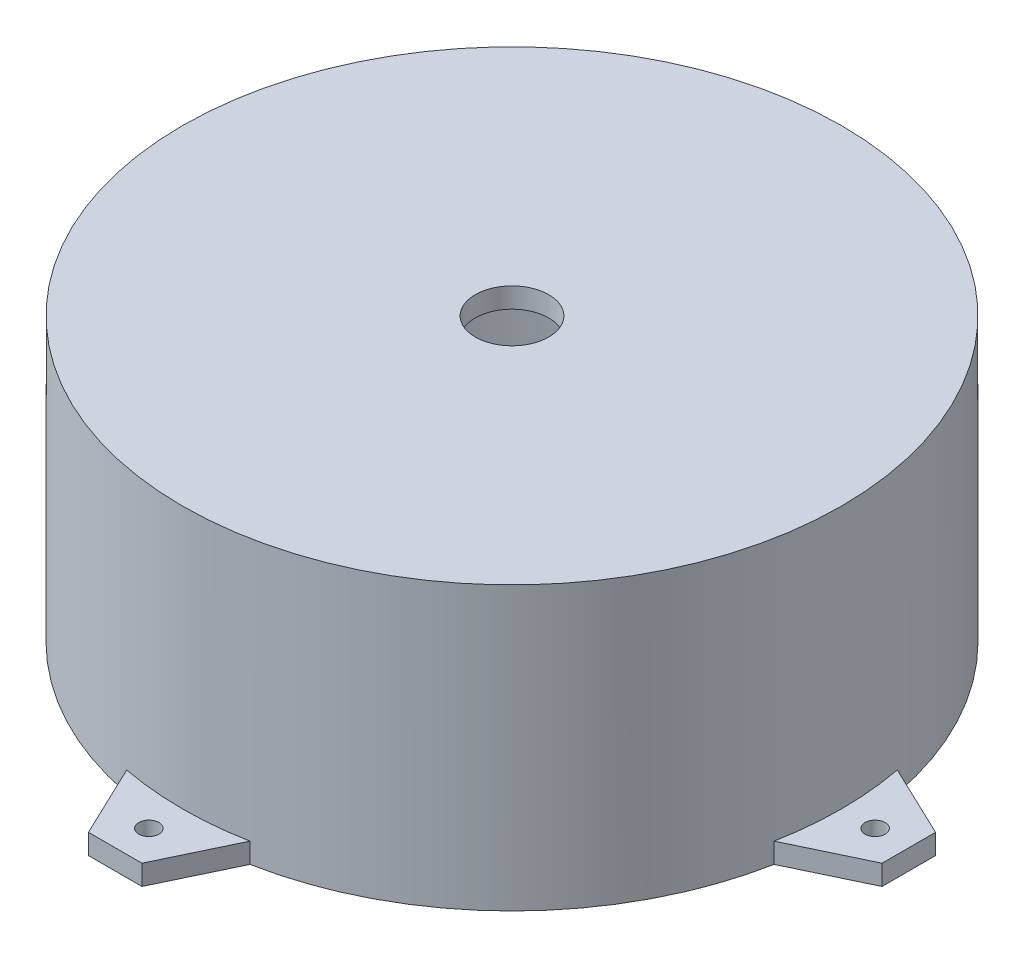
ISO-10303-21;
HEADER;
FILE_DESCRIPTION(('STEP AP214'),'2;1');
FILE_NAME('part.step','',(''),(''),'','','');
FILE_SCHEMA(('AUTOMOTIVE_DESIGN { 1 0 10303 214 1 1 1 1 }'));
ENDSEC;
DATA;
#1=APPLICATION_CONTEXT('core data for automotive mechanical design processes');
#2=APPLICATION_PROTOCOL_DEFINITION('international standard','automotive_design',2000,#1);
#3=PRODUCT_CONTEXT('',#1,'mechanical');
#4=PRODUCT('Part','Part','',(#3));
#5=PRODUCT_RELATED_PRODUCT_CATEGORY('part','',(#4));
#6=PRODUCT_DEFINITION_FORMATION('','',#4);
#7=PRODUCT_DEFINITION_CONTEXT('part definition',#1,'design');
#8=PRODUCT_DEFINITION('design','',#6,#7);
#9=PRODUCT_DEFINITION_SHAPE('','',#8);
#10=(LENGTH_UNIT() NAMED_UNIT(*) SI_UNIT(.MILLI.,.METRE.));
#11=(NAMED_UNIT(*) PLANE_ANGLE_UNIT() SI_UNIT($,.RADIAN.));
#12=(NAMED_UNIT(*) SI_UNIT($,.STERADIAN.) SOLID_ANGLE_UNIT());
#13=UNCERTAINTY_MEASURE_WITH_UNIT(LENGTH_MEASURE(1.E-05),#10,'distance_accuracy_value','');
#14=(GEOMETRIC_REPRESENTATION_CONTEXT(3) GLOBAL_UNCERTAINTY_ASSIGNED_CONTEXT((#13)) GLOBAL_UNIT_ASSIGNED_CONTEXT((#10,
#11,#12)) REPRESENTATION_CONTEXT('',''));
#15=CARTESIAN_POINT('',(0.,0.,0.));
#16=DIRECTION('',(0.,0.,1.));
#17=DIRECTION('',(1.,0.,0.));
#18=AXIS2_PLACEMENT_3D('',#15,#16,#17);
#19=CARTESIAN_POINT('',(-5.78726557773744,31.8512759170654,0.));
#20=DIRECTION('',(0.,-1.,0.));
#21=DIRECTION('',(0.,0.,-1.));
#22=AXIS2_PLACEMENT_3D('',#19,#20,#21);
#23=CYLINDRICAL_SURFACE('',#22,49.);
#24=CARTESIAN_POINT('',(-5.78726557773744,34.8512759170654,0.));
#25=DIRECTION('',(0.,-1.,0.));
#26=DIRECTION('',(0.,0.,-1.));
#27=AXIS2_PLACEMENT_3D('',#24,#25,#26);
#28=CIRCLE('',#27,49.);
#29=CARTESIAN_POINT('',(-5.78726557773744,34.8512759170654,-49.));
#30=VERTEX_POINT('',#29);
#31=EDGE_CURVE('E277',#30,#30,#28,.T.);
#32=ORIENTED_EDGE('',*,*,#31,.T.);
#33=EDGE_LOOP('',(#32));
#34=FACE_BOUND('',#33,.T.);
#35=CARTESIAN_POINT('',(-5.78726557773744,-4.14872408293461,0.));
#36=DIRECTION('',(0.,-1.,0.));
#37=DIRECTION('',(-1.,0.,0.));
#38=AXIS2_PLACEMENT_3D('',#35,#36,#37);
#39=CIRCLE('',#38,49.);
#40=CARTESIAN_POINT('',(3.37210493219753,-4.14872408293461,48.1363265306124));
#41=VERTEX_POINT('',#40);
#42=CARTESIAN_POINT('',(-14.9466360876734,-4.14872408293461,48.1363265306122));
#43=VERTEX_POINT('',#42);
#44=EDGE_CURVE('E168',#41,#43,#39,.T.);
#45=ORIENTED_EDGE('',*,*,#44,.F.);
#46=DIRECTION('',(0.,-1.,0.));
#47=VECTOR('',#46,1.);
#48=CARTESIAN_POINT('',(3.37210493219753,-4.14872408293461,48.1363265306124));
#49=LINE('',#48,#47);
#50=CARTESIAN_POINT('',(3.37210493219753,-7.14872408293461,48.1363265306124));
#51=VERTEX_POINT('',#50);
#52=EDGE_CURVE('E172',#41,#51,#49,.T.);
#53=ORIENTED_EDGE('',*,*,#52,.T.);
#54=CARTESIAN_POINT('',(-5.78726557773744,-7.14872408293461,0.));
#55=DIRECTION('',(0.,-1.,0.));
#56=DIRECTION('',(0.,0.,-1.));
#57=AXIS2_PLACEMENT_3D('',#54,#55,#56);
#58=CIRCLE('',#57,49.);
#59=CARTESIAN_POINT('',(42.3490609528748,-7.14872408293461,9.15937050993548));
#60=VERTEX_POINT('',#59);
#61=EDGE_CURVE('E373',#60,#51,#58,.T.);
#62=ORIENTED_EDGE('',*,*,#61,.F.);
#63=DIRECTION('',(0.,-1.,0.));
#64=VECTOR('',#63,1.);
#65=CARTESIAN_POINT('',(42.3490609528748,-4.14872408293461,9.15937050993547));
#66=LINE('',#65,#64);
#67=CARTESIAN_POINT('',(42.3490609528748,-4.14872408293461,9.15937050993547));
#68=VERTEX_POINT('',#67);
#69=EDGE_CURVE('E209',#68,#60,#66,.T.);
#70=ORIENTED_EDGE('',*,*,#69,.F.);
#71=CARTESIAN_POINT('',(-5.78726557773744,-4.14872408293461,0.));
#72=DIRECTION('',(0.,-1.,0.));
#73=DIRECTION('',(0.,0.,1.));
#74=AXIS2_PLACEMENT_3D('',#71,#72,#73);
#75=CIRCLE('',#74,49.);
#76=CARTESIAN_POINT('',(42.3490609528748,-4.14872408293461,-9.15937050993547));
#77=VERTEX_POINT('',#76);
#78=EDGE_CURVE('E198',#77,#68,#75,.T.);
#79=ORIENTED_EDGE('',*,*,#78,.F.);
#80=DIRECTION('',(0.,-1.,0.));
#81=VECTOR('',#80,1.);
#82=CARTESIAN_POINT('',(42.3490609528748,-4.14872408293461,-9.15937050993547));
#83=LINE('',#82,#81);
#84=CARTESIAN_POINT('',(42.3490609528748,-7.14872408293461,-9.15937050993547));
#85=VERTEX_POINT('',#84);
#86=EDGE_CURVE('E205',#77,#85,#83,.T.);
#87=ORIENTED_EDGE('',*,*,#86,.T.);
#88=CARTESIAN_POINT('',(3.3721049321982,-7.14872408293461,-48.1363265306122));
#89=VERTEX_POINT('',#88);
#90=EDGE_CURVE('E278',#89,#85,#58,.T.);
#91=ORIENTED_EDGE('',*,*,#90,.F.);
#92=DIRECTION('',(0.,-1.,0.));
#93=VECTOR('',#92,1.);
#94=CARTESIAN_POINT('',(3.3721049321982,-4.14872408293461,-48.1363265306122));
#95=LINE('',#94,#93);
#96=CARTESIAN_POINT('',(3.3721049321982,-4.14872408293461,-48.1363265306122));
#97=VERTEX_POINT('',#96);
#98=EDGE_CURVE('E234',#97,#89,#95,.T.);
#99=ORIENTED_EDGE('',*,*,#98,.F.);
#100=CARTESIAN_POINT('',(-5.78726557773744,-4.14872408293461,0.));
#101=DIRECTION('',(0.,-1.,0.));
#102=DIRECTION('',(1.,0.,0.));
#103=AXIS2_PLACEMENT_3D('',#100,#101,#102);
#104=CIRCLE('',#103,49.);
#105=CARTESIAN_POINT('',(-14.9466360876727,-4.14872408293461,-48.1363265306123));
#106=VERTEX_POINT('',#105);
#107=EDGE_CURVE('E223',#106,#97,#104,.T.);
#108=ORIENTED_EDGE('',*,*,#107,.F.);
#109=DIRECTION('',(0.,-1.,0.));
#110=VECTOR('',#109,1.);
#111=CARTESIAN_POINT('',(-14.9466360876727,-4.14872408293461,-48.1363265306123));
#112=LINE('',#111,#110);
#113=CARTESIAN_POINT('',(-14.9466360876727,-7.14872408293461,-48.1363265306123));
#114=VERTEX_POINT('',#113);
#115=EDGE_CURVE('E230',#106,#114,#112,.T.);
#116=ORIENTED_EDGE('',*,*,#115,.T.);
#117=CARTESIAN_POINT('',(-53.9235921083497,-7.14872408293461,-9.15937050993547));
#118=VERTEX_POINT('',#117);
#119=EDGE_CURVE('E274',#118,#114,#58,.T.);
#120=ORIENTED_EDGE('',*,*,#119,.F.);
#121=DIRECTION('',(0.,-1.,0.));
#122=VECTOR('',#121,1.);
#123=CARTESIAN_POINT('',(-53.9235921083497,-4.14872408293461,-9.15937050993547));
#124=LINE('',#123,#122);
#125=CARTESIAN_POINT('',(-53.9235921083497,-4.14872408293461,-9.15937050993547));
#126=VERTEX_POINT('',#125);
#127=EDGE_CURVE('E267',#126,#118,#124,.T.);
#128=ORIENTED_EDGE('',*,*,#127,.F.);
#129=CARTESIAN_POINT('',(-5.78726557773744,-4.14872408293461,0.));
#130=DIRECTION('',(0.,-1.,0.));
#131=DIRECTION('',(0.,0.,-1.));
#132=AXIS2_PLACEMENT_3D('',#129,#130,#131);
#133=CIRCLE('',#132,49.);
#134=CARTESIAN_POINT('',(-53.9235921083497,-4.14872408293461,9.15937050993547));
#135=VERTEX_POINT('',#134);
#136=EDGE_CURVE('E255',#135,#126,#133,.T.);
#137=ORIENTED_EDGE('',*,*,#136,.F.);
#138=DIRECTION('',(0.,-1.,0.));
#139=VECTOR('',#138,1.);
#140=CARTESIAN_POINT('',(-53.9235921083497,-4.14872408293461,9.15937050993547));
#141=LINE('',#140,#139);
#142=CARTESIAN_POINT('',(-53.9235921083497,-7.14872408293461,9.15937050993547));
#143=VERTEX_POINT('',#142);
#144=EDGE_CURVE('E263',#135,#143,#141,.T.);
#145=ORIENTED_EDGE('',*,*,#144,.T.);
#146=CARTESIAN_POINT('',(-14.9466360876734,-7.14872408293461,48.1363265306122));
#147=VERTEX_POINT('',#146);
#148=EDGE_CURVE('E266',#147,#143,#58,.T.);
#149=ORIENTED_EDGE('',*,*,#148,.F.);
#150=DIRECTION('',(0.,-1.,0.));
#151=VECTOR('',#150,1.);
#152=CARTESIAN_POINT('',(-14.9466360876734,-4.14872408293461,48.1363265306122));
#153=LINE('',#152,#151);
#154=EDGE_CURVE('E188',#43,#147,#153,.T.);
#155=ORIENTED_EDGE('',*,*,#154,.F.);
#156=EDGE_LOOP('',(#45,#53,#62,#70,#79,#87,#91,#99,#108,#116,#120,#128,#137,#145,#149,#155));
#157=FACE_BOUND('',#156,.T.);
#158=ADVANCED_FACE('F36',(#34,#157),#23,.T.);
#159=CARTESIAN_POINT('',(40.2127344222626,-7.14872408293461,0.));
#160=DIRECTION('',(0.,-1.,0.));
#161=DIRECTION('',(0.,0.,-1.));
#162=AXIS2_PLACEMENT_3D('',#159,#160,#161);
#163=PLANE('',#162);
#164=CARTESIAN_POINT('',(-5.78726557773801,-7.14872408293461,54.));
#165=DIRECTION('',(0.,-1.,0.));
#166=DIRECTION('',(-1.,0.,0.));
#167=AXIS2_PLACEMENT_3D('',#164,#165,#166);
#168=CIRCLE('',#167,1.5);
#169=CARTESIAN_POINT('',(-7.287265577738,-7.14872408293461,54.));
#170=VERTEX_POINT('',#169);
#171=EDGE_CURVE('E322',#170,#170,#168,.T.);
#172=ORIENTED_EDGE('',*,*,#171,.F.);
#173=EDGE_LOOP('',(#172));
#174=FACE_BOUND('',#173,.T.);
#175=CARTESIAN_POINT('',(48.2127344222626,-7.14872408293461,0.));
#176=DIRECTION('',(0.,-1.,0.));
#177=DIRECTION('',(0.,0.,1.));
#178=AXIS2_PLACEMENT_3D('',#175,#176,#177);
#179=CIRCLE('',#178,1.5);
#180=CARTESIAN_POINT('',(48.2127344222626,-7.14872408293461,1.5));
#181=VERTEX_POINT('',#180);
#182=EDGE_CURVE('E328',#181,#181,#179,.T.);
#183=ORIENTED_EDGE('',*,*,#182,.F.);
#184=EDGE_LOOP('',(#183));
#185=FACE_BOUND('',#184,.T.);
#186=CARTESIAN_POINT('',(-5.78726557773725,-7.14872408293461,-54.));
#187=DIRECTION('',(0.,-1.,0.));
#188=DIRECTION('',(1.,0.,0.));
#189=AXIS2_PLACEMENT_3D('',#186,#187,#188);
#190=CIRCLE('',#189,1.5);
#191=CARTESIAN_POINT('',(-4.28726557773726,-7.14872408293461,-54.));
#192=VERTEX_POINT('',#191);
#193=EDGE_CURVE('E177',#192,#192,#190,.T.);
#194=ORIENTED_EDGE('',*,*,#193,.F.);
#195=EDGE_LOOP('',(#194));
#196=FACE_BOUND('',#195,.T.);
#197=CARTESIAN_POINT('',(-59.7872655777375,-7.14872408293461,0.));
#198=DIRECTION('',(0.,-1.,0.));
#199=DIRECTION('',(0.,0.,-1.));
#200=AXIS2_PLACEMENT_3D('',#197,#198,#199);
#201=CIRCLE('',#200,1.5);
#202=CARTESIAN_POINT('',(-59.7872655777375,-7.14872408293461,-1.5));
#203=VERTEX_POINT('',#202);
#204=EDGE_CURVE('E233',#203,#203,#201,.T.);
#205=ORIENTED_EDGE('',*,*,#204,.F.);
#206=EDGE_LOOP('',(#205));
#207=FACE_BOUND('',#206,.T.);
#208=ORIENTED_EDGE('',*,*,#119,.T.);
#209=DIRECTION('',(-0.4303805412485,0.,0.902647544568005));
#210=VECTOR('',#209,1.);
#211=CARTESIAN_POINT('',(-34.198411216928,-7.14872408293461,-7.75911175555134));
#212=LINE('',#211,#210);
#213=CARTESIAN_POINT('',(-9.76481931361886,-7.14872408293461,-59.0042764939921));
#214=VERTEX_POINT('',#213);
#215=EDGE_CURVE('E208',#214,#114,#212,.T.);
#216=ORIENTED_EDGE('',*,*,#215,.F.);
#217=DIRECTION('',(-1.,0.,0.));
#218=VECTOR('',#217,1.);
#219=CARTESIAN_POINT('',(-5.78726557773723,-7.14872408293461,-59.0042764939921));
#220=LINE('',#219,#218);
#221=CARTESIAN_POINT('',(-1.8097118418556,-7.14872408293461,-59.0042764939921));
#222=VERTEX_POINT('',#221);
#223=EDGE_CURVE('E227',#222,#214,#220,.T.);
#224=ORIENTED_EDGE('',*,*,#223,.F.);
#225=DIRECTION('',(0.430380541248494,0.,0.902647544568008));
#226=VECTOR('',#225,1.);
#227=CARTESIAN_POINT('',(22.6238800614532,-7.14872408293461,-7.75911175555115));
#228=LINE('',#227,#226);
#229=EDGE_CURVE('E218',#222,#89,#228,.T.);
#230=ORIENTED_EDGE('',*,*,#229,.T.);
#231=ORIENTED_EDGE('',*,*,#90,.T.);
#232=DIRECTION('',(-0.902647544568006,0.,-0.430380541248497));
#233=VECTOR('',#232,1.);
#234=CARTESIAN_POINT('',(1.9718461778138,-7.14872408293461,-28.4111456391906));
#235=LINE('',#234,#233);
#236=CARTESIAN_POINT('',(53.2170109162547,-7.14872408293461,-3.97755373588162));
#237=VERTEX_POINT('',#236);
#238=EDGE_CURVE('E187',#237,#85,#235,.T.);
#239=ORIENTED_EDGE('',*,*,#238,.F.);
#240=DIRECTION('',(0.,0.,-1.));
#241=VECTOR('',#240,1.);
#242=CARTESIAN_POINT('',(53.2170109162547,-7.14872408293461,0.));
#243=LINE('',#242,#241);
#244=CARTESIAN_POINT('',(53.2170109162547,-7.14872408293461,3.97755373588163));
#245=VERTEX_POINT('',#244);
#246=EDGE_CURVE('E202',#245,#237,#243,.T.);
#247=ORIENTED_EDGE('',*,*,#246,.F.);
#248=DIRECTION('',(-0.902647544568006,0.,0.430380541248497));
#249=VECTOR('',#248,1.);
#250=CARTESIAN_POINT('',(1.9718461778138,-7.14872408293461,28.4111456391906));
#251=LINE('',#250,#249);
#252=EDGE_CURVE('E58',#245,#60,#251,.T.);
#253=ORIENTED_EDGE('',*,*,#252,.T.);
#254=ORIENTED_EDGE('',*,*,#61,.T.);
#255=DIRECTION('',(0.430380541248506,0.,-0.902647544568002));
#256=VECTOR('',#255,1.);
#257=CARTESIAN_POINT('',(22.6238800614531,-7.14872408293461,7.75911175555154));
#258=LINE('',#257,#256);
#259=CARTESIAN_POINT('',(-1.80971184185643,-7.14872408293461,59.0042764939922));
#260=VERTEX_POINT('',#259);
#261=EDGE_CURVE('E182',#260,#51,#258,.T.);
#262=ORIENTED_EDGE('',*,*,#261,.F.);
#263=DIRECTION('',(1.,0.,0.));
#264=VECTOR('',#263,1.);
#265=CARTESIAN_POINT('',(-5.78726557773806,-7.14872408293461,59.0042764939921));
#266=LINE('',#265,#264);
#267=CARTESIAN_POINT('',(-9.76481931361969,-7.14872408293461,59.0042764939921));
#268=VERTEX_POINT('',#267);
#269=EDGE_CURVE('E164',#268,#260,#266,.T.);
#270=ORIENTED_EDGE('',*,*,#269,.F.);
#271=DIRECTION('',(-0.430380541248487,0.,-0.902647544568011));
#272=VECTOR('',#271,1.);
#273=CARTESIAN_POINT('',(-34.1984112169281,-7.14872408293461,7.75911175555095));
#274=LINE('',#273,#272);
#275=EDGE_CURVE('E51',#268,#147,#274,.T.);
#276=ORIENTED_EDGE('',*,*,#275,.T.);
#277=ORIENTED_EDGE('',*,*,#148,.T.);
#278=DIRECTION('',(0.902647544568006,0.,0.430380541248497));
#279=VECTOR('',#278,1.);
#280=CARTESIAN_POINT('',(-13.5463773332887,-7.14872408293461,28.4111456391906));
#281=LINE('',#280,#279);
#282=CARTESIAN_POINT('',(-64.7915420717296,-7.14872408293461,3.97755373588162));
#283=VERTEX_POINT('',#282);
#284=EDGE_CURVE('E244',#283,#143,#281,.T.);
#285=ORIENTED_EDGE('',*,*,#284,.F.);
#286=DIRECTION('',(0.,0.,1.));
#287=VECTOR('',#286,1.);
#288=CARTESIAN_POINT('',(-64.7915420717296,-7.14872408293461,0.));
#289=LINE('',#288,#287);
#290=CARTESIAN_POINT('',(-64.7915420717296,-7.14872408293461,-3.97755373588163));
#291=VERTEX_POINT('',#290);
#292=EDGE_CURVE('E260',#291,#283,#289,.T.);
#293=ORIENTED_EDGE('',*,*,#292,.F.);
#294=DIRECTION('',(0.902647544568006,0.,-0.430380541248497));
#295=VECTOR('',#294,1.);
#296=CARTESIAN_POINT('',(-13.5463773332887,-7.14872408293461,-28.4111456391906));
#297=LINE('',#296,#295);
#298=EDGE_CURVE('E250',#291,#118,#297,.T.);
#299=ORIENTED_EDGE('',*,*,#298,.T.);
#300=EDGE_LOOP('',(#208,#216,#224,#230,#231,#239,#247,#253,#254,#262,#270,#276,#277,#285,#293,#299));
#301=FACE_BOUND('',#300,.T.);
#302=CARTESIAN_POINT('',(-5.78726557773744,-7.14872408293461,0.));
#303=DIRECTION('',(0.,-1.,0.));
#304=DIRECTION('',(0.,0.,-1.));
#305=AXIS2_PLACEMENT_3D('',#302,#303,#304);
#306=CIRCLE('',#305,46.);
#307=CARTESIAN_POINT('',(-5.78726557773744,-7.14872408293461,-46.));
#308=VERTEX_POINT('',#307);
#309=EDGE_CURVE('E11',#308,#308,#306,.T.);
#310=ORIENTED_EDGE('',*,*,#309,.F.);
#311=EDGE_LOOP('',(#310));
#312=FACE_BOUND('',#311,.T.);
#313=ADVANCED_FACE('F38',(#174,#185,#196,#207,#301,#312),#163,.T.);
#314=CARTESIAN_POINT('',(-5.78726557773744,31.8512759170654,0.));
#315=DIRECTION('',(0.,-1.,0.));
#316=DIRECTION('',(0.,0.,-1.));
#317=AXIS2_PLACEMENT_3D('',#314,#315,#316);
#318=CYLINDRICAL_SURFACE('',#317,46.);
#319=ORIENTED_EDGE('',*,*,#309,.T.);
#320=EDGE_LOOP('',(#319));
#321=FACE_BOUND('',#320,.T.);
#322=CARTESIAN_POINT('',(-5.78726557773744,31.8512759170654,0.));
#323=DIRECTION('',(0.,-1.,0.));
#324=DIRECTION('',(0.,0.,-1.));
#325=AXIS2_PLACEMENT_3D('',#322,#323,#324);
#326=CIRCLE('',#325,46.);
#327=CARTESIAN_POINT('',(-5.78726557773744,31.8512759170654,-46.));
#328=VERTEX_POINT('',#327);
#329=EDGE_CURVE('E44',#328,#328,#326,.T.);
#330=ORIENTED_EDGE('',*,*,#329,.F.);
#331=EDGE_LOOP('',(#330));
#332=FACE_BOUND('',#331,.T.);
#333=ADVANCED_FACE('F285',(#321,#332),#318,.F.);
#334=CARTESIAN_POINT('',(-5.78726557773744,31.8512759170654,0.));
#335=DIRECTION('',(0.,-1.,0.));
#336=DIRECTION('',(0.,0.,-1.));
#337=AXIS2_PLACEMENT_3D('',#334,#335,#336);
#338=PLANE('',#337);
#339=CARTESIAN_POINT('',(-5.78726557773744,31.8512759170654,0.));
#340=DIRECTION('',(0.,1.,0.));
#341=DIRECTION('',(0.,0.,1.));
#342=AXIS2_PLACEMENT_3D('',#339,#340,#341);
#343=CIRCLE('',#342,5.46227);
#344=CARTESIAN_POINT('',(-5.78726557773744,31.8512759170654,5.46227));
#345=VERTEX_POINT('',#344);
#346=EDGE_CURVE('E319',#345,#345,#343,.T.);
#347=ORIENTED_EDGE('',*,*,#346,.T.);
#348=EDGE_LOOP('',(#347));
#349=FACE_BOUND('',#348,.T.);
#350=ORIENTED_EDGE('',*,*,#329,.T.);
#351=EDGE_LOOP('',(#350));
#352=FACE_BOUND('',#351,.T.);
#353=ADVANCED_FACE('F283',(#349,#352),#338,.T.);
#354=CARTESIAN_POINT('',(-5.78726557773744,34.8512759170654,0.));
#355=DIRECTION('',(0.,1.,0.));
#356=DIRECTION('',(0.,0.,1.));
#357=AXIS2_PLACEMENT_3D('',#354,#355,#356);
#358=PLANE('',#357);
#359=CARTESIAN_POINT('',(-5.78726557773744,34.8512759170654,0.));
#360=DIRECTION('',(0.,1.,0.));
#361=DIRECTION('',(0.,0.,1.));
#362=AXIS2_PLACEMENT_3D('',#359,#360,#361);
#363=CIRCLE('',#362,5.46227);
#364=CARTESIAN_POINT('',(-5.78726557773744,34.8512759170654,5.46227));
#365=VERTEX_POINT('',#364);
#366=EDGE_CURVE('E316',#365,#365,#363,.T.);
#367=ORIENTED_EDGE('',*,*,#366,.F.);
#368=EDGE_LOOP('',(#367));
#369=FACE_BOUND('',#368,.T.);
#370=ORIENTED_EDGE('',*,*,#31,.F.);
#371=EDGE_LOOP('',(#370));
#372=FACE_BOUND('',#371,.T.);
#373=ADVANCED_FACE('F292',(#369,#372),#358,.T.);
#374=CARTESIAN_POINT('',(-13.5463773332887,-4.14872408293461,28.4111456391906));
#375=DIRECTION('',(0.430380541248497,0.,-0.902647544568006));
#376=DIRECTION('',(-0.902647544568006,0.,-0.430380541248497));
#377=AXIS2_PLACEMENT_3D('',#374,#375,#376);
#378=PLANE('',#377);
#379=ORIENTED_EDGE('',*,*,#284,.T.);
#380=ORIENTED_EDGE('',*,*,#144,.F.);
#381=DIRECTION('',(0.902647544568006,0.,0.430380541248497));
#382=VECTOR('',#381,1.);
#383=CARTESIAN_POINT('',(-13.5463773332887,-4.14872408293461,28.4111456391906));
#384=LINE('',#383,#382);
#385=CARTESIAN_POINT('',(-64.7915420717296,-4.14872408293461,3.97755373588162));
#386=VERTEX_POINT('',#385);
#387=EDGE_CURVE('E247',#386,#135,#384,.T.);
#388=ORIENTED_EDGE('',*,*,#387,.F.);
#389=DIRECTION('',(0.,-1.,0.));
#390=VECTOR('',#389,1.);
#391=CARTESIAN_POINT('',(-64.7915420717296,-4.14872408293461,3.97755373588162));
#392=LINE('',#391,#390);
#393=EDGE_CURVE('E257',#386,#283,#392,.T.);
#394=ORIENTED_EDGE('',*,*,#393,.T.);
#395=EDGE_LOOP('',(#379,#380,#388,#394));
#396=FACE_BOUND('',#395,.T.);
#397=ADVANCED_FACE('F304',(#396),#378,.F.);
#398=CARTESIAN_POINT('',(-13.5463773332887,-4.14872408293461,-28.4111456391906));
#399=DIRECTION('',(-0.430380541248497,0.,-0.902647544568006));
#400=DIRECTION('',(-0.902647544568006,0.,0.430380541248497));
#401=AXIS2_PLACEMENT_3D('',#398,#399,#400);
#402=PLANE('',#401);
#403=ORIENTED_EDGE('',*,*,#298,.F.);
#404=DIRECTION('',(0.,-1.,0.));
#405=VECTOR('',#404,1.);
#406=CARTESIAN_POINT('',(-64.7915420717296,-4.14872408293461,-3.97755373588163));
#407=LINE('',#406,#405);
#408=CARTESIAN_POINT('',(-64.7915420717296,-4.14872408293461,-3.97755373588163));
#409=VERTEX_POINT('',#408);
#410=EDGE_CURVE('E270',#409,#291,#407,.T.);
#411=ORIENTED_EDGE('',*,*,#410,.F.);
#412=DIRECTION('',(0.902647544568006,0.,-0.430380541248497));
#413=VECTOR('',#412,1.);
#414=CARTESIAN_POINT('',(-13.5463773332887,-4.14872408293461,-28.4111456391906));
#415=LINE('',#414,#413);
#416=EDGE_CURVE('E252',#409,#126,#415,.T.);
#417=ORIENTED_EDGE('',*,*,#416,.T.);
#418=ORIENTED_EDGE('',*,*,#127,.T.);
#419=EDGE_LOOP('',(#403,#411,#417,#418));
#420=FACE_BOUND('',#419,.T.);
#421=ADVANCED_FACE('F311',(#420),#402,.T.);
#422=CARTESIAN_POINT('',(-64.7915420717296,-4.14872408293461,0.));
#423=DIRECTION('',(1.,0.,0.));
#424=DIRECTION('',(0.,0.,-1.));
#425=AXIS2_PLACEMENT_3D('',#422,#423,#424);
#426=PLANE('',#425);
#427=ORIENTED_EDGE('',*,*,#292,.T.);
#428=ORIENTED_EDGE('',*,*,#393,.F.);
#429=DIRECTION('',(0.,0.,1.));
#430=VECTOR('',#429,1.);
#431=CARTESIAN_POINT('',(-64.7915420717296,-4.14872408293461,0.));
#432=LINE('',#431,#430);
#433=EDGE_CURVE('E249',#409,#386,#432,.T.);
#434=ORIENTED_EDGE('',*,*,#433,.F.);
#435=ORIENTED_EDGE('',*,*,#410,.T.);
#436=EDGE_LOOP('',(#427,#428,#434,#435));
#437=FACE_BOUND('',#436,.T.);
#438=ADVANCED_FACE('F387',(#437),#426,.F.);
#439=CARTESIAN_POINT('',(0.,-4.14872408293461,0.));
#440=DIRECTION('',(0.,-1.,0.));
#441=DIRECTION('',(0.,0.,-1.));
#442=AXIS2_PLACEMENT_3D('',#439,#440,#441);
#443=PLANE('',#442);
#444=CARTESIAN_POINT('',(-59.7872655777375,-4.14872408293461,0.));
#445=DIRECTION('',(0.,-1.,0.));
#446=DIRECTION('',(0.,0.,-1.));
#447=AXIS2_PLACEMENT_3D('',#444,#445,#446);
#448=CIRCLE('',#447,1.5);
#449=CARTESIAN_POINT('',(-59.7872655777375,-4.14872408293461,-1.5));
#450=VERTEX_POINT('',#449);
#451=EDGE_CURVE('E241',#450,#450,#448,.T.);
#452=ORIENTED_EDGE('',*,*,#451,.T.);
#453=EDGE_LOOP('',(#452));
#454=FACE_BOUND('',#453,.T.);
#455=ORIENTED_EDGE('',*,*,#387,.T.);
#456=ORIENTED_EDGE('',*,*,#136,.T.);
#457=ORIENTED_EDGE('',*,*,#416,.F.);
#458=ORIENTED_EDGE('',*,*,#433,.T.);
#459=EDGE_LOOP('',(#455,#456,#457,#458));
#460=FACE_BOUND('',#459,.T.);
#461=ADVANCED_FACE('F383',(#454,#460),#443,.F.);
#462=CARTESIAN_POINT('',(-59.7872655777375,-4.14872408293461,0.));
#463=DIRECTION('',(0.,-1.,0.));
#464=DIRECTION('',(0.,0.,-1.));
#465=AXIS2_PLACEMENT_3D('',#462,#463,#464);
#466=CYLINDRICAL_SURFACE('',#465,1.5);
#467=ORIENTED_EDGE('',*,*,#451,.F.);
#468=EDGE_LOOP('',(#467));
#469=FACE_BOUND('',#468,.T.);
#470=ORIENTED_EDGE('',*,*,#204,.T.);
#471=EDGE_LOOP('',(#470));
#472=FACE_BOUND('',#471,.T.);
#473=ADVANCED_FACE('F393',(#469,#472),#466,.F.);
#474=CARTESIAN_POINT('',(-34.198411216928,-4.14872408293461,-7.75911175555134));
#475=DIRECTION('',(0.902647544568005,0.,0.4303805412485));
#476=DIRECTION('',(0.4303805412485,0.,-0.902647544568005));
#477=AXIS2_PLACEMENT_3D('',#474,#475,#476);
#478=PLANE('',#477);
#479=ORIENTED_EDGE('',*,*,#215,.T.);
#480=ORIENTED_EDGE('',*,*,#115,.F.);
#481=DIRECTION('',(-0.4303805412485,0.,0.902647544568005));
#482=VECTOR('',#481,1.);
#483=CARTESIAN_POINT('',(-34.198411216928,-4.14872408293461,-7.75911175555134));
#484=LINE('',#483,#482);
#485=CARTESIAN_POINT('',(-9.76481931361886,-4.14872408293461,-59.0042764939921));
#486=VERTEX_POINT('',#485);
#487=EDGE_CURVE('E215',#486,#106,#484,.T.);
#488=ORIENTED_EDGE('',*,*,#487,.F.);
#489=DIRECTION('',(0.,-1.,0.));
#490=VECTOR('',#489,1.);
#491=CARTESIAN_POINT('',(-9.76481931361886,-4.14872408293461,-59.0042764939921));
#492=LINE('',#491,#490);
#493=EDGE_CURVE('E225',#486,#214,#492,.T.);
#494=ORIENTED_EDGE('',*,*,#493,.T.);
#495=EDGE_LOOP('',(#479,#480,#488,#494));
#496=FACE_BOUND('',#495,.T.);
#497=ADVANCED_FACE('F359',(#496),#478,.F.);
#498=CARTESIAN_POINT('',(22.6238800614532,-4.14872408293461,-7.75911175555115));
#499=DIRECTION('',(0.902647544568008,0.,-0.430380541248494));
#500=DIRECTION('',(-0.430380541248494,0.,-0.902647544568008));
#501=AXIS2_PLACEMENT_3D('',#498,#499,#500);
#502=PLANE('',#501);
#503=ORIENTED_EDGE('',*,*,#229,.F.);
#504=DIRECTION('',(0.,-1.,0.));
#505=VECTOR('',#504,1.);
#506=CARTESIAN_POINT('',(-1.8097118418556,-4.14872408293461,-59.0042764939921));
#507=LINE('',#506,#505);
#508=CARTESIAN_POINT('',(-1.8097118418556,-4.14872408293461,-59.0042764939921));
#509=VERTEX_POINT('',#508);
#510=EDGE_CURVE('E237',#509,#222,#507,.T.);
#511=ORIENTED_EDGE('',*,*,#510,.F.);
#512=DIRECTION('',(0.430380541248494,0.,0.902647544568008));
#513=VECTOR('',#512,1.);
#514=CARTESIAN_POINT('',(22.6238800614532,-4.14872408293461,-7.75911175555115));
#515=LINE('',#514,#513);
#516=EDGE_CURVE('E220',#509,#97,#515,.T.);
#517=ORIENTED_EDGE('',*,*,#516,.T.);
#518=ORIENTED_EDGE('',*,*,#98,.T.);
#519=EDGE_LOOP('',(#503,#511,#517,#518));
#520=FACE_BOUND('',#519,.T.);
#521=ADVANCED_FACE('F368',(#520),#502,.T.);
#522=CARTESIAN_POINT('',(-5.78726557773723,-4.14872408293461,-59.0042764939921));
#523=DIRECTION('',(0.,0.,1.));
#524=DIRECTION('',(1.,0.,0.));
#525=AXIS2_PLACEMENT_3D('',#522,#523,#524);
#526=PLANE('',#525);
#527=ORIENTED_EDGE('',*,*,#223,.T.);
#528=ORIENTED_EDGE('',*,*,#493,.F.);
#529=DIRECTION('',(-1.,0.,0.));
#530=VECTOR('',#529,1.);
#531=CARTESIAN_POINT('',(-5.78726557773723,-4.14872408293461,-59.0042764939921));
#532=LINE('',#531,#530);
#533=EDGE_CURVE('E217',#509,#486,#532,.T.);
#534=ORIENTED_EDGE('',*,*,#533,.F.);
#535=ORIENTED_EDGE('',*,*,#510,.T.);
#536=EDGE_LOOP('',(#527,#528,#534,#535));
#537=FACE_BOUND('',#536,.T.);
#538=ADVANCED_FACE('F363',(#537),#526,.F.);
#539=CARTESIAN_POINT('',(-5.78726557773746,-4.14872408293461,5.78726557773744));
#540=DIRECTION('',(0.,-1.,0.));
#541=DIRECTION('',(1.,0.,0.));
#542=AXIS2_PLACEMENT_3D('',#539,#540,#541);
#543=PLANE('',#542);
#544=CARTESIAN_POINT('',(-5.78726557773725,-4.14872408293461,-54.));
#545=DIRECTION('',(0.,-1.,0.));
#546=DIRECTION('',(1.,0.,0.));
#547=AXIS2_PLACEMENT_3D('',#544,#545,#546);
#548=CIRCLE('',#547,1.5);
#549=CARTESIAN_POINT('',(-4.28726557773726,-4.14872408293461,-54.));
#550=VERTEX_POINT('',#549);
#551=EDGE_CURVE('E184',#550,#550,#548,.T.);
#552=ORIENTED_EDGE('',*,*,#551,.T.);
#553=EDGE_LOOP('',(#552));
#554=FACE_BOUND('',#553,.T.);
#555=ORIENTED_EDGE('',*,*,#487,.T.);
#556=ORIENTED_EDGE('',*,*,#107,.T.);
#557=ORIENTED_EDGE('',*,*,#516,.F.);
#558=ORIENTED_EDGE('',*,*,#533,.T.);
#559=EDGE_LOOP('',(#555,#556,#557,#558));
#560=FACE_BOUND('',#559,.T.);
#561=ADVANCED_FACE('F405',(#554,#560),#543,.F.);
#562=CARTESIAN_POINT('',(1.9718461778138,-4.14872408293461,-28.4111456391906));
#563=DIRECTION('',(-0.430380541248497,0.,0.902647544568006));
#564=DIRECTION('',(0.902647544568006,0.,0.430380541248497));
#565=AXIS2_PLACEMENT_3D('',#562,#563,#564);
#566=PLANE('',#565);
#567=ORIENTED_EDGE('',*,*,#238,.T.);
#568=ORIENTED_EDGE('',*,*,#86,.F.);
#569=DIRECTION('',(-0.902647544568006,0.,-0.430380541248497));
#570=VECTOR('',#569,1.);
#571=CARTESIAN_POINT('',(1.9718461778138,-4.14872408293461,-28.4111456391906));
#572=LINE('',#571,#570);
#573=CARTESIAN_POINT('',(53.2170109162547,-4.14872408293461,-3.97755373588162));
#574=VERTEX_POINT('',#573);
#575=EDGE_CURVE('E191',#574,#77,#572,.T.);
#576=ORIENTED_EDGE('',*,*,#575,.F.);
#577=DIRECTION('',(0.,-1.,0.));
#578=VECTOR('',#577,1.);
#579=CARTESIAN_POINT('',(53.2170109162547,-4.14872408293461,-3.97755373588162));
#580=LINE('',#579,#578);
#581=EDGE_CURVE('E200',#574,#237,#580,.T.);
#582=ORIENTED_EDGE('',*,*,#581,.T.);
#583=EDGE_LOOP('',(#567,#568,#576,#582));
#584=FACE_BOUND('',#583,.T.);
#585=ADVANCED_FACE('F410',(#584),#566,.F.);
#586=CARTESIAN_POINT('',(1.9718461778138,-4.14872408293461,28.4111456391906));
#587=DIRECTION('',(0.430380541248497,0.,0.902647544568006));
#588=DIRECTION('',(0.902647544568006,0.,-0.430380541248497));
#589=AXIS2_PLACEMENT_3D('',#586,#587,#588);
#590=PLANE('',#589);
#591=ORIENTED_EDGE('',*,*,#252,.F.);
#592=DIRECTION('',(0.,-1.,0.));
#593=VECTOR('',#592,1.);
#594=CARTESIAN_POINT('',(53.2170109162547,-4.14872408293461,3.97755373588163));
#595=LINE('',#594,#593);
#596=CARTESIAN_POINT('',(53.2170109162547,-4.14872408293461,3.97755373588163));
#597=VERTEX_POINT('',#596);
#598=EDGE_CURVE('E211',#597,#245,#595,.T.);
#599=ORIENTED_EDGE('',*,*,#598,.F.);
#600=DIRECTION('',(-0.902647544568006,0.,0.430380541248497));
#601=VECTOR('',#600,1.);
#602=CARTESIAN_POINT('',(1.9718461778138,-4.14872408293461,28.4111456391906));
#603=LINE('',#602,#601);
#604=EDGE_CURVE('E195',#597,#68,#603,.T.);
#605=ORIENTED_EDGE('',*,*,#604,.T.);
#606=ORIENTED_EDGE('',*,*,#69,.T.);
#607=EDGE_LOOP('',(#591,#599,#605,#606));
#608=FACE_BOUND('',#607,.T.);
#609=ADVANCED_FACE('F413',(#608),#590,.T.);
#610=CARTESIAN_POINT('',(53.2170109162547,-4.14872408293461,0.));
#611=DIRECTION('',(-1.,0.,0.));
#612=DIRECTION('',(0.,0.,1.));
#613=AXIS2_PLACEMENT_3D('',#610,#611,#612);
#614=PLANE('',#613);
#615=ORIENTED_EDGE('',*,*,#246,.T.);
#616=ORIENTED_EDGE('',*,*,#581,.F.);
#617=DIRECTION('',(0.,0.,-1.));
#618=VECTOR('',#617,1.);
#619=CARTESIAN_POINT('',(53.2170109162547,-4.14872408293461,0.));
#620=LINE('',#619,#618);
#621=EDGE_CURVE('E193',#597,#574,#620,.T.);
#622=ORIENTED_EDGE('',*,*,#621,.F.);
#623=ORIENTED_EDGE('',*,*,#598,.T.);
#624=EDGE_LOOP('',(#615,#616,#622,#623));
#625=FACE_BOUND('',#624,.T.);
#626=ADVANCED_FACE('F415',(#625),#614,.F.);
#627=CARTESIAN_POINT('',(-11.5745311554749,-4.14872408293461,0.));
#628=DIRECTION('',(0.,-1.,0.));
#629=DIRECTION('',(0.,0.,1.));
#630=AXIS2_PLACEMENT_3D('',#627,#628,#629);
#631=PLANE('',#630);
#632=CARTESIAN_POINT('',(48.2127344222626,-4.14872408293461,0.));
#633=DIRECTION('',(0.,-1.,0.));
#634=DIRECTION('',(0.,0.,1.));
#635=AXIS2_PLACEMENT_3D('',#632,#633,#634);
#636=CIRCLE('',#635,1.5);
#637=CARTESIAN_POINT('',(48.2127344222626,-4.14872408293461,1.5));
#638=VERTEX_POINT('',#637);
#639=EDGE_CURVE('E331',#638,#638,#636,.T.);
#640=ORIENTED_EDGE('',*,*,#639,.T.);
#641=EDGE_LOOP('',(#640));
#642=FACE_BOUND('',#641,.T.);
#643=ORIENTED_EDGE('',*,*,#575,.T.);
#644=ORIENTED_EDGE('',*,*,#78,.T.);
#645=ORIENTED_EDGE('',*,*,#604,.F.);
#646=ORIENTED_EDGE('',*,*,#621,.T.);
#647=EDGE_LOOP('',(#643,#644,#645,#646));
#648=FACE_BOUND('',#647,.T.);
#649=ADVANCED_FACE('F418',(#642,#648),#631,.F.);
#650=CARTESIAN_POINT('',(22.6238800614531,-4.14872408293461,7.75911175555154));
#651=DIRECTION('',(-0.902647544568002,0.,-0.430380541248506));
#652=DIRECTION('',(-0.430380541248506,0.,0.902647544568002));
#653=AXIS2_PLACEMENT_3D('',#650,#651,#652);
#654=PLANE('',#653);
#655=ORIENTED_EDGE('',*,*,#261,.T.);
#656=ORIENTED_EDGE('',*,*,#52,.F.);
#657=DIRECTION('',(0.430380541248506,0.,-0.902647544568002));
#658=VECTOR('',#657,1.);
#659=CARTESIAN_POINT('',(22.6238800614531,-4.14872408293461,7.75911175555154));
#660=LINE('',#659,#658);
#661=CARTESIAN_POINT('',(-1.80971184185643,-4.14872408293461,59.0042764939922));
#662=VERTEX_POINT('',#661);
#663=EDGE_CURVE('E155',#662,#41,#660,.T.);
#664=ORIENTED_EDGE('',*,*,#663,.F.);
#665=DIRECTION('',(0.,-1.,0.));
#666=VECTOR('',#665,1.);
#667=CARTESIAN_POINT('',(-1.80971184185643,-4.14872408293461,59.0042764939922));
#668=LINE('',#667,#666);
#669=EDGE_CURVE('E162',#662,#260,#668,.T.);
#670=ORIENTED_EDGE('',*,*,#669,.T.);
#671=EDGE_LOOP('',(#655,#656,#664,#670));
#672=FACE_BOUND('',#671,.T.);
#673=ADVANCED_FACE('F170',(#672),#654,.F.);
#674=CARTESIAN_POINT('',(-34.1984112169281,-4.14872408293461,7.75911175555095));
#675=DIRECTION('',(-0.902647544568011,0.,0.430380541248487));
#676=DIRECTION('',(0.430380541248487,0.,0.902647544568011));
#677=AXIS2_PLACEMENT_3D('',#674,#675,#676);
#678=PLANE('',#677);
#679=ORIENTED_EDGE('',*,*,#275,.F.);
#680=DIRECTION('',(0.,-1.,0.));
#681=VECTOR('',#680,1.);
#682=CARTESIAN_POINT('',(-9.76481931361969,-4.14872408293461,59.0042764939921));
#683=LINE('',#682,#681);
#684=CARTESIAN_POINT('',(-9.76481931361969,-4.14872408293461,59.0042764939921));
#685=VERTEX_POINT('',#684);
#686=EDGE_CURVE('E167',#685,#268,#683,.T.);
#687=ORIENTED_EDGE('',*,*,#686,.F.);
#688=DIRECTION('',(-0.430380541248487,0.,-0.902647544568011));
#689=VECTOR('',#688,1.);
#690=CARTESIAN_POINT('',(-34.1984112169281,-4.14872408293461,7.75911175555095));
#691=LINE('',#690,#689);
#692=EDGE_CURVE('E158',#685,#43,#691,.T.);
#693=ORIENTED_EDGE('',*,*,#692,.T.);
#694=ORIENTED_EDGE('',*,*,#154,.T.);
#695=EDGE_LOOP('',(#679,#687,#693,#694));
#696=FACE_BOUND('',#695,.T.);
#697=ADVANCED_FACE('F428',(#696),#678,.T.);
#698=CARTESIAN_POINT('',(-5.78726557773806,-4.14872408293461,59.0042764939921));
#699=DIRECTION('',(0.,0.,-1.));
#700=DIRECTION('',(-1.,0.,0.));
#701=AXIS2_PLACEMENT_3D('',#698,#699,#700);
#702=PLANE('',#701);
#703=ORIENTED_EDGE('',*,*,#269,.T.);
#704=ORIENTED_EDGE('',*,*,#669,.F.);
#705=DIRECTION('',(1.,0.,0.));
#706=VECTOR('',#705,1.);
#707=CARTESIAN_POINT('',(-5.78726557773806,-4.14872408293461,59.0042764939921));
#708=LINE('',#707,#706);
#709=EDGE_CURVE('E151',#685,#662,#708,.T.);
#710=ORIENTED_EDGE('',*,*,#709,.F.);
#711=ORIENTED_EDGE('',*,*,#686,.T.);
#712=EDGE_LOOP('',(#703,#704,#710,#711));
#713=FACE_BOUND('',#712,.T.);
#714=ADVANCED_FACE('F163',(#713),#702,.F.);
#715=CARTESIAN_POINT('',(-5.78726557773738,-4.14872408293461,-5.78726557773744));
#716=DIRECTION('',(0.,-1.,0.));
#717=DIRECTION('',(-1.,0.,0.));
#718=AXIS2_PLACEMENT_3D('',#715,#716,#717);
#719=PLANE('',#718);
#720=CARTESIAN_POINT('',(-5.78726557773801,-4.14872408293461,54.));
#721=DIRECTION('',(0.,-1.,0.));
#722=DIRECTION('',(-1.,0.,0.));
#723=AXIS2_PLACEMENT_3D('',#720,#721,#722);
#724=CIRCLE('',#723,1.5);
#725=CARTESIAN_POINT('',(-7.287265577738,-4.14872408293461,54.));
#726=VERTEX_POINT('',#725);
#727=EDGE_CURVE('E325',#726,#726,#724,.T.);
#728=ORIENTED_EDGE('',*,*,#727,.T.);
#729=EDGE_LOOP('',(#728));
#730=FACE_BOUND('',#729,.T.);
#731=ORIENTED_EDGE('',*,*,#663,.T.);
#732=ORIENTED_EDGE('',*,*,#44,.T.);
#733=ORIENTED_EDGE('',*,*,#692,.F.);
#734=ORIENTED_EDGE('',*,*,#709,.T.);
#735=EDGE_LOOP('',(#731,#732,#733,#734));
#736=FACE_BOUND('',#735,.T.);
#737=ADVANCED_FACE('F153',(#730,#736),#719,.F.);
#738=CARTESIAN_POINT('',(-5.78726557773725,-4.14872408293461,-54.));
#739=DIRECTION('',(0.,-1.,0.));
#740=DIRECTION('',(0.,0.,-1.));
#741=AXIS2_PLACEMENT_3D('',#738,#739,#740);
#742=CYLINDRICAL_SURFACE('',#741,1.5);
#743=ORIENTED_EDGE('',*,*,#551,.F.);
#744=EDGE_LOOP('',(#743));
#745=FACE_BOUND('',#744,.T.);
#746=ORIENTED_EDGE('',*,*,#193,.T.);
#747=EDGE_LOOP('',(#746));
#748=FACE_BOUND('',#747,.T.);
#749=ADVANCED_FACE('F341',(#745,#748),#742,.F.);
#750=CARTESIAN_POINT('',(48.2127344222626,-4.14872408293461,0.));
#751=DIRECTION('',(0.,-1.,0.));
#752=DIRECTION('',(0.,0.,-1.));
#753=AXIS2_PLACEMENT_3D('',#750,#751,#752);
#754=CYLINDRICAL_SURFACE('',#753,1.5);
#755=ORIENTED_EDGE('',*,*,#639,.F.);
#756=EDGE_LOOP('',(#755));
#757=FACE_BOUND('',#756,.T.);
#758=ORIENTED_EDGE('',*,*,#182,.T.);
#759=EDGE_LOOP('',(#758));
#760=FACE_BOUND('',#759,.T.);
#761=ADVANCED_FACE('F439',(#757,#760),#754,.F.);
#762=CARTESIAN_POINT('',(-5.78726557773801,-4.14872408293461,54.));
#763=DIRECTION('',(0.,-1.,0.));
#764=DIRECTION('',(0.,0.,-1.));
#765=AXIS2_PLACEMENT_3D('',#762,#763,#764);
#766=CYLINDRICAL_SURFACE('',#765,1.5);
#767=ORIENTED_EDGE('',*,*,#727,.F.);
#768=EDGE_LOOP('',(#767));
#769=FACE_BOUND('',#768,.T.);
#770=ORIENTED_EDGE('',*,*,#171,.T.);
#771=EDGE_LOOP('',(#770));
#772=FACE_BOUND('',#771,.T.);
#773=ADVANCED_FACE('F443',(#769,#772),#766,.F.);
#774=CARTESIAN_POINT('',(-5.78726557773744,31.8512759170654,0.));
#775=DIRECTION('',(0.,1.,0.));
#776=DIRECTION('',(0.,0.,1.));
#777=AXIS2_PLACEMENT_3D('',#774,#775,#776);
#778=CYLINDRICAL_SURFACE('',#777,5.46227);
#779=ORIENTED_EDGE('',*,*,#346,.F.);
#780=EDGE_LOOP('',(#779));
#781=FACE_BOUND('',#780,.T.);
#782=ORIENTED_EDGE('',*,*,#366,.T.);
#783=EDGE_LOOP('',(#782));
#784=FACE_BOUND('',#783,.T.);
#785=ADVANCED_FACE('F447',(#781,#784),#778,.F.);
#786=CLOSED_SHELL('',(#158,#313,#333,#353,#373,#397,#421,#438,#461,#473,#497,#521,#538,#561,
#585,#609,#626,#649,#673,#697,#714,#737,#749,#761,#773,#785));
#787=MANIFOLD_SOLID_BREP('B2',#786);
#788=ADVANCED_BREP_SHAPE_REPRESENTATION('',(#18,#787),#14);
#789=SHAPE_DEFINITION_REPRESENTATION(#9,#788);
ENDSEC;
END-ISO-10303-21;
